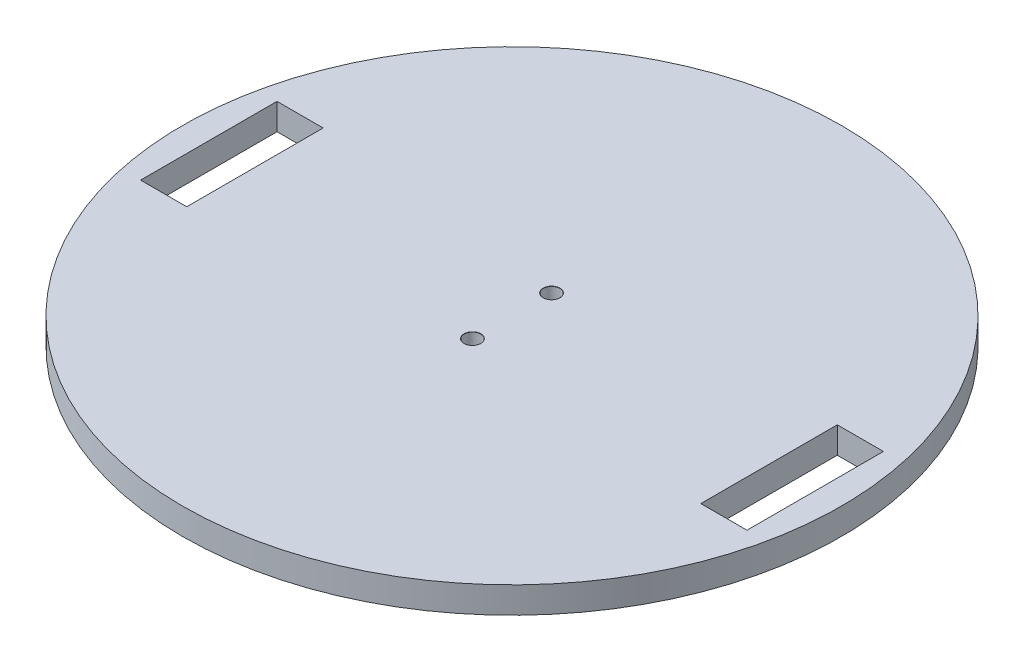
ISO-10303-21;
HEADER;
FILE_DESCRIPTION(('STEP AP214'),'2;1');
FILE_NAME('part.step','',(''),(''),'','','');
FILE_SCHEMA(('AUTOMOTIVE_DESIGN { 1 0 10303 214 1 1 1 1 }'));
ENDSEC;
DATA;
#1=APPLICATION_CONTEXT('core data for automotive mechanical design processes');
#2=APPLICATION_PROTOCOL_DEFINITION('international standard','automotive_design',2000,#1);
#3=PRODUCT_CONTEXT('',#1,'mechanical');
#4=PRODUCT('Part','Part','',(#3));
#5=PRODUCT_RELATED_PRODUCT_CATEGORY('part','',(#4));
#6=PRODUCT_DEFINITION_FORMATION('','',#4);
#7=PRODUCT_DEFINITION_CONTEXT('part definition',#1,'design');
#8=PRODUCT_DEFINITION('design','',#6,#7);
#9=PRODUCT_DEFINITION_SHAPE('','',#8);
#10=(LENGTH_UNIT() NAMED_UNIT(*) SI_UNIT(.MILLI.,.METRE.));
#11=(NAMED_UNIT(*) PLANE_ANGLE_UNIT() SI_UNIT($,.RADIAN.));
#12=(NAMED_UNIT(*) SI_UNIT($,.STERADIAN.) SOLID_ANGLE_UNIT());
#13=UNCERTAINTY_MEASURE_WITH_UNIT(LENGTH_MEASURE(1.E-05),#10,'distance_accuracy_value','');
#14=(GEOMETRIC_REPRESENTATION_CONTEXT(3) GLOBAL_UNCERTAINTY_ASSIGNED_CONTEXT((#13)) GLOBAL_UNIT_ASSIGNED_CONTEXT((#10,
#11,#12)) REPRESENTATION_CONTEXT('',''));
#15=CARTESIAN_POINT('',(0.,0.,0.));
#16=DIRECTION('',(0.,0.,1.));
#17=DIRECTION('',(1.,0.,0.));
#18=AXIS2_PLACEMENT_3D('',#15,#16,#17);
#19=CARTESIAN_POINT('',(0.,4.,0.));
#20=DIRECTION('',(0.,1.,0.));
#21=DIRECTION('',(0.,0.,1.));
#22=AXIS2_PLACEMENT_3D('',#19,#20,#21);
#23=PLANE('',#22);
#24=DIRECTION('',(-1.,0.,0.));
#25=VECTOR('',#24,1.);
#26=CARTESIAN_POINT('',(0.,4.,-10.35));
#27=LINE('',#26,#25);
#28=CARTESIAN_POINT('',(46.,4.,-10.35));
#29=VERTEX_POINT('',#28);
#30=CARTESIAN_POINT('',(39.,4.,-10.35));
#31=VERTEX_POINT('',#30);
#32=EDGE_CURVE('E185',#29,#31,#27,.T.);
#33=ORIENTED_EDGE('',*,*,#32,.F.);
#34=DIRECTION('',(0.,0.,-1.));
#35=VECTOR('',#34,1.);
#36=CARTESIAN_POINT('',(46.,4.,0.));
#37=LINE('',#36,#35);
#38=CARTESIAN_POINT('',(46.,4.,10.35));
#39=VERTEX_POINT('',#38);
#40=EDGE_CURVE('E144',#39,#29,#37,.T.);
#41=ORIENTED_EDGE('',*,*,#40,.F.);
#42=DIRECTION('',(-1.,0.,0.));
#43=VECTOR('',#42,1.);
#44=CARTESIAN_POINT('',(0.,4.,10.35));
#45=LINE('',#44,#43);
#46=CARTESIAN_POINT('',(39.,4.,10.35));
#47=VERTEX_POINT('',#46);
#48=EDGE_CURVE('E177',#39,#47,#45,.T.);
#49=ORIENTED_EDGE('',*,*,#48,.T.);
#50=DIRECTION('',(0.,0.,-1.));
#51=VECTOR('',#50,1.);
#52=CARTESIAN_POINT('',(39.,4.,0.));
#53=LINE('',#52,#51);
#54=EDGE_CURVE('E181',#47,#31,#53,.T.);
#55=ORIENTED_EDGE('',*,*,#54,.T.);
#56=EDGE_LOOP('',(#33,#41,#49,#55));
#57=FACE_BOUND('',#56,.T.);
#58=CARTESIAN_POINT('',(0.,4.,-6.));
#59=DIRECTION('',(0.,1.,0.));
#60=DIRECTION('',(0.,0.,1.));
#61=AXIS2_PLACEMENT_3D('',#58,#59,#60);
#62=CIRCLE('',#61,1.275);
#63=CARTESIAN_POINT('',(0.,4.,-4.725));
#64=VERTEX_POINT('',#63);
#65=EDGE_CURVE('E200',#64,#64,#62,.T.);
#66=ORIENTED_EDGE('',*,*,#65,.F.);
#67=EDGE_LOOP('',(#66));
#68=FACE_BOUND('',#67,.T.);
#69=CARTESIAN_POINT('',(0.,4.,6.));
#70=DIRECTION('',(0.,1.,0.));
#71=DIRECTION('',(0.,0.,1.));
#72=AXIS2_PLACEMENT_3D('',#69,#70,#71);
#73=CIRCLE('',#72,1.275);
#74=CARTESIAN_POINT('',(0.,4.,7.275));
#75=VERTEX_POINT('',#74);
#76=EDGE_CURVE('E212',#75,#75,#73,.T.);
#77=ORIENTED_EDGE('',*,*,#76,.F.);
#78=EDGE_LOOP('',(#77));
#79=FACE_BOUND('',#78,.T.);
#80=CARTESIAN_POINT('',(0.,4.,0.));
#81=DIRECTION('',(0.,1.,0.));
#82=DIRECTION('',(0.,0.,1.));
#83=AXIS2_PLACEMENT_3D('',#80,#81,#82);
#84=CIRCLE('',#83,50.);
#85=CARTESIAN_POINT('',(0.,4.,50.));
#86=VERTEX_POINT('',#85);
#87=EDGE_CURVE('E11',#86,#86,#84,.T.);
#88=ORIENTED_EDGE('',*,*,#87,.T.);
#89=EDGE_LOOP('',(#88));
#90=FACE_BOUND('',#89,.T.);
#91=DIRECTION('',(1.,0.,0.));
#92=VECTOR('',#91,1.);
#93=CARTESIAN_POINT('',(0.,4.,10.35));
#94=LINE('',#93,#92);
#95=CARTESIAN_POINT('',(-46.,4.,10.35));
#96=VERTEX_POINT('',#95);
#97=CARTESIAN_POINT('',(-39.,4.,10.35));
#98=VERTEX_POINT('',#97);
#99=EDGE_CURVE('E193',#96,#98,#94,.T.);
#100=ORIENTED_EDGE('',*,*,#99,.F.);
#101=DIRECTION('',(0.,0.,-1.));
#102=VECTOR('',#101,1.);
#103=CARTESIAN_POINT('',(-46.,4.,0.));
#104=LINE('',#103,#102);
#105=CARTESIAN_POINT('',(-46.,4.,-10.35));
#106=VERTEX_POINT('',#105);
#107=EDGE_CURVE('E196',#96,#106,#104,.T.);
#108=ORIENTED_EDGE('',*,*,#107,.T.);
#109=DIRECTION('',(1.,0.,0.));
#110=VECTOR('',#109,1.);
#111=CARTESIAN_POINT('',(0.,4.,-10.35));
#112=LINE('',#111,#110);
#113=CARTESIAN_POINT('',(-39.,4.,-10.35));
#114=VERTEX_POINT('',#113);
#115=EDGE_CURVE('E188',#106,#114,#112,.T.);
#116=ORIENTED_EDGE('',*,*,#115,.T.);
#117=DIRECTION('',(0.,0.,-1.));
#118=VECTOR('',#117,1.);
#119=CARTESIAN_POINT('',(-39.,4.,0.));
#120=LINE('',#119,#118);
#121=EDGE_CURVE('E116',#98,#114,#120,.T.);
#122=ORIENTED_EDGE('',*,*,#121,.F.);
#123=EDGE_LOOP('',(#100,#108,#116,#122));
#124=FACE_BOUND('',#123,.T.);
#125=ADVANCED_FACE('F45',(#57,#68,#79,#90,#124),#23,.T.);
#126=CARTESIAN_POINT('',(0.,0.,0.));
#127=DIRECTION('',(0.,1.,0.));
#128=DIRECTION('',(0.,0.,1.));
#129=AXIS2_PLACEMENT_3D('',#126,#127,#128);
#130=PLANE('',#129);
#131=CARTESIAN_POINT('',(0.,0.,0.));
#132=DIRECTION('',(0.,1.,0.));
#133=DIRECTION('',(0.,0.,1.));
#134=AXIS2_PLACEMENT_3D('',#131,#132,#133);
#135=CIRCLE('',#134,50.);
#136=CARTESIAN_POINT('',(0.,0.,50.));
#137=VERTEX_POINT('',#136);
#138=EDGE_CURVE('E49',#137,#137,#135,.T.);
#139=ORIENTED_EDGE('',*,*,#138,.F.);
#140=EDGE_LOOP('',(#139));
#141=FACE_BOUND('',#140,.T.);
#142=CARTESIAN_POINT('',(0.,0.,6.));
#143=DIRECTION('',(0.,1.,0.));
#144=DIRECTION('',(0.,0.,1.));
#145=AXIS2_PLACEMENT_3D('',#142,#143,#144);
#146=CIRCLE('',#145,1.25);
#147=CARTESIAN_POINT('',(0.,0.,7.25));
#148=VERTEX_POINT('',#147);
#149=EDGE_CURVE('E220',#148,#148,#146,.T.);
#150=ORIENTED_EDGE('',*,*,#149,.T.);
#151=EDGE_LOOP('',(#150));
#152=FACE_BOUND('',#151,.T.);
#153=CARTESIAN_POINT('',(0.,0.,-6.));
#154=DIRECTION('',(0.,1.,0.));
#155=DIRECTION('',(0.,0.,1.));
#156=AXIS2_PLACEMENT_3D('',#153,#154,#155);
#157=CIRCLE('',#156,1.25);
#158=CARTESIAN_POINT('',(0.,0.,-4.75));
#159=VERTEX_POINT('',#158);
#160=EDGE_CURVE('E208',#159,#159,#157,.T.);
#161=ORIENTED_EDGE('',*,*,#160,.T.);
#162=EDGE_LOOP('',(#161));
#163=FACE_BOUND('',#162,.T.);
#164=DIRECTION('',(0.,0.,1.));
#165=VECTOR('',#164,1.);
#166=CARTESIAN_POINT('',(46.,0.,0.));
#167=LINE('',#166,#165);
#168=CARTESIAN_POINT('',(46.,0.,-10.35));
#169=VERTEX_POINT('',#168);
#170=CARTESIAN_POINT('',(46.,0.,10.35));
#171=VERTEX_POINT('',#170);
#172=EDGE_CURVE('E152',#169,#171,#167,.T.);
#173=ORIENTED_EDGE('',*,*,#172,.F.);
#174=DIRECTION('',(1.,0.,0.));
#175=VECTOR('',#174,1.);
#176=CARTESIAN_POINT('',(0.,0.,-10.35));
#177=LINE('',#176,#175);
#178=CARTESIAN_POINT('',(39.,0.,-10.35));
#179=VERTEX_POINT('',#178);
#180=EDGE_CURVE('E149',#179,#169,#177,.T.);
#181=ORIENTED_EDGE('',*,*,#180,.F.);
#182=DIRECTION('',(0.,0.,1.));
#183=VECTOR('',#182,1.);
#184=CARTESIAN_POINT('',(39.,0.,0.));
#185=LINE('',#184,#183);
#186=CARTESIAN_POINT('',(39.,0.,10.35));
#187=VERTEX_POINT('',#186);
#188=EDGE_CURVE('E159',#179,#187,#185,.T.);
#189=ORIENTED_EDGE('',*,*,#188,.T.);
#190=DIRECTION('',(1.,0.,0.));
#191=VECTOR('',#190,1.);
#192=CARTESIAN_POINT('',(0.,0.,10.35));
#193=LINE('',#192,#191);
#194=EDGE_CURVE('E155',#187,#171,#193,.T.);
#195=ORIENTED_EDGE('',*,*,#194,.T.);
#196=EDGE_LOOP('',(#173,#181,#189,#195));
#197=FACE_BOUND('',#196,.T.);
#198=DIRECTION('',(0.,0.,1.));
#199=VECTOR('',#198,1.);
#200=CARTESIAN_POINT('',(-46.,0.,0.));
#201=LINE('',#200,#199);
#202=CARTESIAN_POINT('',(-46.,0.,-10.35));
#203=VERTEX_POINT('',#202);
#204=CARTESIAN_POINT('',(-46.,0.,10.35));
#205=VERTEX_POINT('',#204);
#206=EDGE_CURVE('E130',#203,#205,#201,.T.);
#207=ORIENTED_EDGE('',*,*,#206,.T.);
#208=DIRECTION('',(-1.,0.,0.));
#209=VECTOR('',#208,1.);
#210=CARTESIAN_POINT('',(0.,0.,10.35));
#211=LINE('',#210,#209);
#212=CARTESIAN_POINT('',(-39.,0.,10.35));
#213=VERTEX_POINT('',#212);
#214=EDGE_CURVE('E134',#213,#205,#211,.T.);
#215=ORIENTED_EDGE('',*,*,#214,.F.);
#216=DIRECTION('',(0.,0.,1.));
#217=VECTOR('',#216,1.);
#218=CARTESIAN_POINT('',(-39.,0.,0.));
#219=LINE('',#218,#217);
#220=CARTESIAN_POINT('',(-39.,0.,-10.35));
#221=VERTEX_POINT('',#220);
#222=EDGE_CURVE('E113',#221,#213,#219,.T.);
#223=ORIENTED_EDGE('',*,*,#222,.F.);
#224=DIRECTION('',(-1.,0.,0.));
#225=VECTOR('',#224,1.);
#226=CARTESIAN_POINT('',(0.,0.,-10.35));
#227=LINE('',#226,#225);
#228=EDGE_CURVE('E124',#221,#203,#227,.T.);
#229=ORIENTED_EDGE('',*,*,#228,.T.);
#230=EDGE_LOOP('',(#207,#215,#223,#229));
#231=FACE_BOUND('',#230,.T.);
#232=ADVANCED_FACE('F132',(#141,#152,#163,#197,#231),#130,.F.);
#233=CARTESIAN_POINT('',(0.,4.,0.));
#234=DIRECTION('',(0.,-1.,0.));
#235=DIRECTION('',(0.,0.,-1.));
#236=AXIS2_PLACEMENT_3D('',#233,#234,#235);
#237=CYLINDRICAL_SURFACE('',#236,50.);
#238=ORIENTED_EDGE('',*,*,#87,.F.);
#239=EDGE_LOOP('',(#238));
#240=FACE_BOUND('',#239,.T.);
#241=ORIENTED_EDGE('',*,*,#138,.T.);
#242=EDGE_LOOP('',(#241));
#243=FACE_BOUND('',#242,.T.);
#244=ADVANCED_FACE('F47',(#240,#243),#237,.T.);
#245=CARTESIAN_POINT('',(0.,4.,6.));
#246=DIRECTION('',(0.,1.,0.));
#247=DIRECTION('',(0.,0.,1.));
#248=AXIS2_PLACEMENT_3D('',#245,#246,#247);
#249=CYLINDRICAL_SURFACE('',#248,1.25);
#250=ORIENTED_EDGE('',*,*,#149,.F.);
#251=EDGE_LOOP('',(#250));
#252=FACE_BOUND('',#251,.T.);
#253=CARTESIAN_POINT('',(0.,3.975,6.));
#254=DIRECTION('',(0.,1.,0.));
#255=DIRECTION('',(0.,0.,1.));
#256=AXIS2_PLACEMENT_3D('',#253,#254,#255);
#257=CIRCLE('',#256,1.25);
#258=CARTESIAN_POINT('',(0.,3.975,7.25));
#259=VERTEX_POINT('',#258);
#260=EDGE_CURVE('E216',#259,#259,#257,.T.);
#261=ORIENTED_EDGE('',*,*,#260,.T.);
#262=EDGE_LOOP('',(#261));
#263=FACE_BOUND('',#262,.T.);
#264=ADVANCED_FACE('F267',(#252,#263),#249,.F.);
#265=CARTESIAN_POINT('',(0.,4.,6.));
#266=DIRECTION('',(0.,1.,0.));
#267=DIRECTION('',(0.,0.,1.));
#268=AXIS2_PLACEMENT_3D('',#265,#266,#267);
#269=CONICAL_SURFACE('',#268,1.275,0.785398163397414);
#270=ORIENTED_EDGE('',*,*,#260,.F.);
#271=EDGE_LOOP('',(#270));
#272=FACE_BOUND('',#271,.T.);
#273=ORIENTED_EDGE('',*,*,#76,.T.);
#274=EDGE_LOOP('',(#273));
#275=FACE_BOUND('',#274,.T.);
#276=ADVANCED_FACE('F270',(#272,#275),#269,.F.);
#277=CARTESIAN_POINT('',(0.,4.,-6.));
#278=DIRECTION('',(0.,1.,0.));
#279=DIRECTION('',(0.,0.,1.));
#280=AXIS2_PLACEMENT_3D('',#277,#278,#279);
#281=CYLINDRICAL_SURFACE('',#280,1.25);
#282=ORIENTED_EDGE('',*,*,#160,.F.);
#283=EDGE_LOOP('',(#282));
#284=FACE_BOUND('',#283,.T.);
#285=CARTESIAN_POINT('',(0.,3.975,-6.));
#286=DIRECTION('',(0.,1.,0.));
#287=DIRECTION('',(0.,0.,1.));
#288=AXIS2_PLACEMENT_3D('',#285,#286,#287);
#289=CIRCLE('',#288,1.25);
#290=CARTESIAN_POINT('',(0.,3.975,-4.75));
#291=VERTEX_POINT('',#290);
#292=EDGE_CURVE('E204',#291,#291,#289,.T.);
#293=ORIENTED_EDGE('',*,*,#292,.T.);
#294=EDGE_LOOP('',(#293));
#295=FACE_BOUND('',#294,.T.);
#296=ADVANCED_FACE('F274',(#284,#295),#281,.F.);
#297=CARTESIAN_POINT('',(0.,4.,-6.));
#298=DIRECTION('',(0.,1.,0.));
#299=DIRECTION('',(0.,0.,1.));
#300=AXIS2_PLACEMENT_3D('',#297,#298,#299);
#301=CONICAL_SURFACE('',#300,1.275,0.785398163397414);
#302=ORIENTED_EDGE('',*,*,#292,.F.);
#303=EDGE_LOOP('',(#302));
#304=FACE_BOUND('',#303,.T.);
#305=ORIENTED_EDGE('',*,*,#65,.T.);
#306=EDGE_LOOP('',(#305));
#307=FACE_BOUND('',#306,.T.);
#308=ADVANCED_FACE('F278',(#304,#307),#301,.F.);
#309=CARTESIAN_POINT('',(0.,10.,-10.35));
#310=DIRECTION('',(0.,0.,-1.));
#311=DIRECTION('',(-1.,0.,0.));
#312=AXIS2_PLACEMENT_3D('',#309,#310,#311);
#313=PLANE('',#312);
#314=ORIENTED_EDGE('',*,*,#32,.T.);
#315=DIRECTION('',(0.,-1.,0.));
#316=VECTOR('',#315,1.);
#317=CARTESIAN_POINT('',(39.,10.,-10.35));
#318=LINE('',#317,#316);
#319=EDGE_CURVE('E164',#31,#179,#318,.T.);
#320=ORIENTED_EDGE('',*,*,#319,.T.);
#321=ORIENTED_EDGE('',*,*,#180,.T.);
#322=DIRECTION('',(0.,-1.,0.));
#323=VECTOR('',#322,1.);
#324=CARTESIAN_POINT('',(46.,10.,-10.35));
#325=LINE('',#324,#323);
#326=EDGE_CURVE('E163',#29,#169,#325,.T.);
#327=ORIENTED_EDGE('',*,*,#326,.F.);
#328=EDGE_LOOP('',(#314,#320,#321,#327));
#329=FACE_BOUND('',#328,.T.);
#330=ADVANCED_FACE('F242',(#329),#313,.F.);
#331=CARTESIAN_POINT('',(39.,10.,0.));
#332=DIRECTION('',(1.,0.,0.));
#333=DIRECTION('',(0.,0.,-1.));
#334=AXIS2_PLACEMENT_3D('',#331,#332,#333);
#335=PLANE('',#334);
#336=DIRECTION('',(0.,-1.,0.));
#337=VECTOR('',#336,1.);
#338=CARTESIAN_POINT('',(39.,10.,10.35));
#339=LINE('',#338,#337);
#340=EDGE_CURVE('E167',#47,#187,#339,.T.);
#341=ORIENTED_EDGE('',*,*,#340,.T.);
#342=ORIENTED_EDGE('',*,*,#188,.F.);
#343=ORIENTED_EDGE('',*,*,#319,.F.);
#344=ORIENTED_EDGE('',*,*,#54,.F.);
#345=EDGE_LOOP('',(#341,#342,#343,#344));
#346=FACE_BOUND('',#345,.T.);
#347=ADVANCED_FACE('F248',(#346),#335,.T.);
#348=CARTESIAN_POINT('',(0.,10.,10.35));
#349=DIRECTION('',(0.,0.,-1.));
#350=DIRECTION('',(-1.,0.,0.));
#351=AXIS2_PLACEMENT_3D('',#348,#349,#350);
#352=PLANE('',#351);
#353=DIRECTION('',(0.,-1.,0.));
#354=VECTOR('',#353,1.);
#355=CARTESIAN_POINT('',(46.,10.,10.35));
#356=LINE('',#355,#354);
#357=EDGE_CURVE('E69',#39,#171,#356,.T.);
#358=ORIENTED_EDGE('',*,*,#357,.T.);
#359=ORIENTED_EDGE('',*,*,#194,.F.);
#360=ORIENTED_EDGE('',*,*,#340,.F.);
#361=ORIENTED_EDGE('',*,*,#48,.F.);
#362=EDGE_LOOP('',(#358,#359,#360,#361));
#363=FACE_BOUND('',#362,.T.);
#364=ADVANCED_FACE('F251',(#363),#352,.T.);
#365=CARTESIAN_POINT('',(46.,10.,0.));
#366=DIRECTION('',(1.,0.,0.));
#367=DIRECTION('',(0.,0.,-1.));
#368=AXIS2_PLACEMENT_3D('',#365,#366,#367);
#369=PLANE('',#368);
#370=ORIENTED_EDGE('',*,*,#40,.T.);
#371=ORIENTED_EDGE('',*,*,#326,.T.);
#372=ORIENTED_EDGE('',*,*,#172,.T.);
#373=ORIENTED_EDGE('',*,*,#357,.F.);
#374=EDGE_LOOP('',(#370,#371,#372,#373));
#375=FACE_BOUND('',#374,.T.);
#376=ADVANCED_FACE('F237',(#375),#369,.F.);
#377=CARTESIAN_POINT('',(-46.,10.,0.));
#378=DIRECTION('',(1.,0.,0.));
#379=DIRECTION('',(0.,0.,-1.));
#380=AXIS2_PLACEMENT_3D('',#377,#378,#379);
#381=PLANE('',#380);
#382=DIRECTION('',(0.,-1.,0.));
#383=VECTOR('',#382,1.);
#384=CARTESIAN_POINT('',(-46.,10.,10.35));
#385=LINE('',#384,#383);
#386=EDGE_CURVE('E141',#96,#205,#385,.T.);
#387=ORIENTED_EDGE('',*,*,#386,.T.);
#388=ORIENTED_EDGE('',*,*,#206,.F.);
#389=DIRECTION('',(0.,-1.,0.));
#390=VECTOR('',#389,1.);
#391=CARTESIAN_POINT('',(-46.,10.,-10.35));
#392=LINE('',#391,#390);
#393=EDGE_CURVE('E120',#106,#203,#392,.T.);
#394=ORIENTED_EDGE('',*,*,#393,.F.);
#395=ORIENTED_EDGE('',*,*,#107,.F.);
#396=EDGE_LOOP('',(#387,#388,#394,#395));
#397=FACE_BOUND('',#396,.T.);
#398=ADVANCED_FACE('F258',(#397),#381,.T.);
#399=CARTESIAN_POINT('',(0.,10.,10.35));
#400=DIRECTION('',(0.,0.,1.));
#401=DIRECTION('',(1.,0.,0.));
#402=AXIS2_PLACEMENT_3D('',#399,#400,#401);
#403=PLANE('',#402);
#404=ORIENTED_EDGE('',*,*,#99,.T.);
#405=DIRECTION('',(0.,-1.,0.));
#406=VECTOR('',#405,1.);
#407=CARTESIAN_POINT('',(-39.,10.,10.35));
#408=LINE('',#407,#406);
#409=EDGE_CURVE('E119',#98,#213,#408,.T.);
#410=ORIENTED_EDGE('',*,*,#409,.T.);
#411=ORIENTED_EDGE('',*,*,#214,.T.);
#412=ORIENTED_EDGE('',*,*,#386,.F.);
#413=EDGE_LOOP('',(#404,#410,#411,#412));
#414=FACE_BOUND('',#413,.T.);
#415=ADVANCED_FACE('F313',(#414),#403,.F.);
#416=CARTESIAN_POINT('',(-39.,10.,0.));
#417=DIRECTION('',(1.,0.,0.));
#418=DIRECTION('',(0.,0.,-1.));
#419=AXIS2_PLACEMENT_3D('',#416,#417,#418);
#420=PLANE('',#419);
#421=ORIENTED_EDGE('',*,*,#121,.T.);
#422=DIRECTION('',(0.,-1.,0.));
#423=VECTOR('',#422,1.);
#424=CARTESIAN_POINT('',(-39.,10.,-10.35));
#425=LINE('',#424,#423);
#426=EDGE_CURVE('E61',#114,#221,#425,.T.);
#427=ORIENTED_EDGE('',*,*,#426,.T.);
#428=ORIENTED_EDGE('',*,*,#222,.T.);
#429=ORIENTED_EDGE('',*,*,#409,.F.);
#430=EDGE_LOOP('',(#421,#427,#428,#429));
#431=FACE_BOUND('',#430,.T.);
#432=ADVANCED_FACE('F110',(#431),#420,.F.);
#433=CARTESIAN_POINT('',(0.,10.,-10.35));
#434=DIRECTION('',(0.,0.,1.));
#435=DIRECTION('',(1.,0.,0.));
#436=AXIS2_PLACEMENT_3D('',#433,#434,#435);
#437=PLANE('',#436);
#438=ORIENTED_EDGE('',*,*,#393,.T.);
#439=ORIENTED_EDGE('',*,*,#228,.F.);
#440=ORIENTED_EDGE('',*,*,#426,.F.);
#441=ORIENTED_EDGE('',*,*,#115,.F.);
#442=EDGE_LOOP('',(#438,#439,#440,#441));
#443=FACE_BOUND('',#442,.T.);
#444=ADVANCED_FACE('F125',(#443),#437,.T.);
#445=CLOSED_SHELL('',(#125,#232,#244,#264,#276,#296,#308,#330,#347,#364,#376,#398,#415,#432,#444));
#446=MANIFOLD_SOLID_BREP('B2',#445);
#447=ADVANCED_BREP_SHAPE_REPRESENTATION('',(#18,#446),#14);
#448=SHAPE_DEFINITION_REPRESENTATION(#9,#447);
ENDSEC;
END-ISO-10303-21;
